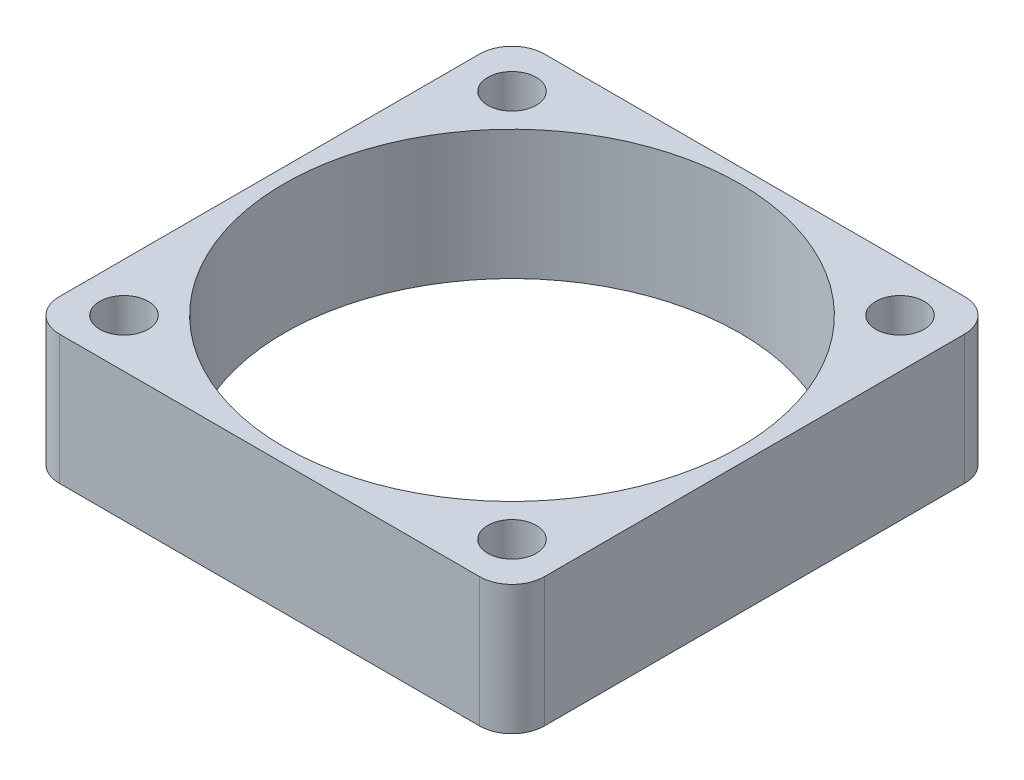
ISO-10303-21;
HEADER;
FILE_DESCRIPTION(('STEP AP214'),'2;1');
FILE_NAME('part.step','',(''),(''),'','','');
FILE_SCHEMA(('AUTOMOTIVE_DESIGN { 1 0 10303 214 1 1 1 1 }'));
ENDSEC;
DATA;
#1=APPLICATION_CONTEXT('core data for automotive mechanical design processes');
#2=APPLICATION_PROTOCOL_DEFINITION('international standard','automotive_design',2000,#1);
#3=PRODUCT_CONTEXT('',#1,'mechanical');
#4=PRODUCT('Part','Part','',(#3));
#5=PRODUCT_RELATED_PRODUCT_CATEGORY('part','',(#4));
#6=PRODUCT_DEFINITION_FORMATION('','',#4);
#7=PRODUCT_DEFINITION_CONTEXT('part definition',#1,'design');
#8=PRODUCT_DEFINITION('design','',#6,#7);
#9=PRODUCT_DEFINITION_SHAPE('','',#8);
#10=(LENGTH_UNIT() NAMED_UNIT(*) SI_UNIT(.MILLI.,.METRE.));
#11=(NAMED_UNIT(*) PLANE_ANGLE_UNIT() SI_UNIT($,.RADIAN.));
#12=(NAMED_UNIT(*) SI_UNIT($,.STERADIAN.) SOLID_ANGLE_UNIT());
#13=UNCERTAINTY_MEASURE_WITH_UNIT(LENGTH_MEASURE(1.E-05),#10,'distance_accuracy_value','');
#14=(GEOMETRIC_REPRESENTATION_CONTEXT(3) GLOBAL_UNCERTAINTY_ASSIGNED_CONTEXT((#13)) GLOBAL_UNIT_ASSIGNED_CONTEXT((#10,
#11,#12)) REPRESENTATION_CONTEXT('',''));
#15=CARTESIAN_POINT('',(0.,0.,0.));
#16=DIRECTION('',(0.,0.,1.));
#17=DIRECTION('',(1.,0.,0.));
#18=AXIS2_PLACEMENT_3D('',#15,#16,#17);
#19=CARTESIAN_POINT('',(-15.,8.,-15.));
#20=DIRECTION('',(1.,0.,0.));
#21=DIRECTION('',(0.,0.,-1.));
#22=AXIS2_PLACEMENT_3D('',#19,#20,#21);
#23=PLANE('',#22);
#24=DIRECTION('',(0.,0.,1.));
#25=VECTOR('',#24,1.);
#26=CARTESIAN_POINT('',(-15.,8.,-15.));
#27=LINE('',#26,#25);
#28=CARTESIAN_POINT('',(-15.,8.,-13.));
#29=VERTEX_POINT('',#28);
#30=CARTESIAN_POINT('',(-15.,8.,13.));
#31=VERTEX_POINT('',#30);
#32=EDGE_CURVE('E117',#29,#31,#27,.T.);
#33=ORIENTED_EDGE('',*,*,#32,.F.);
#34=DIRECTION('',(0.,-1.,0.));
#35=VECTOR('',#34,1.);
#36=CARTESIAN_POINT('',(-15.,8.,-13.));
#37=LINE('',#36,#35);
#38=CARTESIAN_POINT('',(-15.,0.,-13.));
#39=VERTEX_POINT('',#38);
#40=EDGE_CURVE('E102',#29,#39,#37,.T.);
#41=ORIENTED_EDGE('',*,*,#40,.T.);
#42=DIRECTION('',(0.,0.,1.));
#43=VECTOR('',#42,1.);
#44=CARTESIAN_POINT('',(-15.,0.,-15.));
#45=LINE('',#44,#43);
#46=CARTESIAN_POINT('',(-15.,0.,13.));
#47=VERTEX_POINT('',#46);
#48=EDGE_CURVE('E114',#39,#47,#45,.T.);
#49=ORIENTED_EDGE('',*,*,#48,.T.);
#50=DIRECTION('',(0.,-1.,0.));
#51=VECTOR('',#50,1.);
#52=CARTESIAN_POINT('',(-15.,8.,13.));
#53=LINE('',#52,#51);
#54=EDGE_CURVE('E119',#47,#31,#53,.F.);
#55=ORIENTED_EDGE('',*,*,#54,.T.);
#56=EDGE_LOOP('',(#33,#41,#49,#55));
#57=FACE_BOUND('',#56,.T.);
#58=ADVANCED_FACE('F33',(#57),#23,.F.);
#59=CARTESIAN_POINT('',(15.,8.,15.));
#60=DIRECTION('',(0.,0.,-1.));
#61=DIRECTION('',(-1.,0.,0.));
#62=AXIS2_PLACEMENT_3D('',#59,#60,#61);
#63=PLANE('',#62);
#64=DIRECTION('',(1.,0.,0.));
#65=VECTOR('',#64,1.);
#66=CARTESIAN_POINT('',(15.,8.,15.));
#67=LINE('',#66,#65);
#68=CARTESIAN_POINT('',(-13.,8.,15.));
#69=VERTEX_POINT('',#68);
#70=CARTESIAN_POINT('',(13.,8.,15.));
#71=VERTEX_POINT('',#70);
#72=EDGE_CURVE('E172',#69,#71,#67,.T.);
#73=ORIENTED_EDGE('',*,*,#72,.F.);
#74=DIRECTION('',(0.,-1.,0.));
#75=VECTOR('',#74,1.);
#76=CARTESIAN_POINT('',(-13.,8.,15.));
#77=LINE('',#76,#75);
#78=CARTESIAN_POINT('',(-13.,0.,15.));
#79=VERTEX_POINT('',#78);
#80=EDGE_CURVE('E156',#69,#79,#77,.T.);
#81=ORIENTED_EDGE('',*,*,#80,.T.);
#82=DIRECTION('',(1.,0.,0.));
#83=VECTOR('',#82,1.);
#84=CARTESIAN_POINT('',(15.,0.,15.));
#85=LINE('',#84,#83);
#86=CARTESIAN_POINT('',(13.,0.,15.));
#87=VERTEX_POINT('',#86);
#88=EDGE_CURVE('E123',#79,#87,#85,.T.);
#89=ORIENTED_EDGE('',*,*,#88,.T.);
#90=DIRECTION('',(0.,-1.,0.));
#91=VECTOR('',#90,1.);
#92=CARTESIAN_POINT('',(13.,8.,15.));
#93=LINE('',#92,#91);
#94=EDGE_CURVE('E154',#87,#71,#93,.F.);
#95=ORIENTED_EDGE('',*,*,#94,.T.);
#96=EDGE_LOOP('',(#73,#81,#89,#95));
#97=FACE_BOUND('',#96,.T.);
#98=ADVANCED_FACE('F239',(#97),#63,.F.);
#99=CARTESIAN_POINT('',(15.,8.,-15.));
#100=DIRECTION('',(-1.,0.,0.));
#101=DIRECTION('',(0.,0.,1.));
#102=AXIS2_PLACEMENT_3D('',#99,#100,#101);
#103=PLANE('',#102);
#104=DIRECTION('',(0.,0.,-1.));
#105=VECTOR('',#104,1.);
#106=CARTESIAN_POINT('',(15.,0.,-15.));
#107=LINE('',#106,#105);
#108=CARTESIAN_POINT('',(15.,0.,13.));
#109=VERTEX_POINT('',#108);
#110=CARTESIAN_POINT('',(15.,0.,-13.));
#111=VERTEX_POINT('',#110);
#112=EDGE_CURVE('E127',#109,#111,#107,.T.);
#113=ORIENTED_EDGE('',*,*,#112,.T.);
#114=DIRECTION('',(0.,-1.,0.));
#115=VECTOR('',#114,1.);
#116=CARTESIAN_POINT('',(15.,8.,-13.));
#117=LINE('',#116,#115);
#118=CARTESIAN_POINT('',(15.,8.,-13.));
#119=VERTEX_POINT('',#118);
#120=EDGE_CURVE('E11',#111,#119,#117,.F.);
#121=ORIENTED_EDGE('',*,*,#120,.T.);
#122=DIRECTION('',(0.,0.,-1.));
#123=VECTOR('',#122,1.);
#124=CARTESIAN_POINT('',(15.,8.,-15.));
#125=LINE('',#124,#123);
#126=CARTESIAN_POINT('',(15.,8.,13.));
#127=VERTEX_POINT('',#126);
#128=EDGE_CURVE('E162',#127,#119,#125,.T.);
#129=ORIENTED_EDGE('',*,*,#128,.F.);
#130=DIRECTION('',(0.,-1.,0.));
#131=VECTOR('',#130,1.);
#132=CARTESIAN_POINT('',(15.,8.,13.));
#133=LINE('',#132,#131);
#134=EDGE_CURVE('E41',#127,#109,#133,.T.);
#135=ORIENTED_EDGE('',*,*,#134,.T.);
#136=EDGE_LOOP('',(#113,#121,#129,#135));
#137=FACE_BOUND('',#136,.T.);
#138=ADVANCED_FACE('F161',(#137),#103,.F.);
#139=CARTESIAN_POINT('',(15.,8.,-15.));
#140=DIRECTION('',(0.,0.,1.));
#141=DIRECTION('',(1.,0.,0.));
#142=AXIS2_PLACEMENT_3D('',#139,#140,#141);
#143=PLANE('',#142);
#144=DIRECTION('',(-1.,0.,0.));
#145=VECTOR('',#144,1.);
#146=CARTESIAN_POINT('',(15.,0.,-15.));
#147=LINE('',#146,#145);
#148=CARTESIAN_POINT('',(13.,0.,-15.));
#149=VERTEX_POINT('',#148);
#150=CARTESIAN_POINT('',(-13.,0.,-15.));
#151=VERTEX_POINT('',#150);
#152=EDGE_CURVE('E137',#149,#151,#147,.T.);
#153=ORIENTED_EDGE('',*,*,#152,.T.);
#154=DIRECTION('',(0.,-1.,0.));
#155=VECTOR('',#154,1.);
#156=CARTESIAN_POINT('',(-13.,8.,-15.));
#157=LINE('',#156,#155);
#158=CARTESIAN_POINT('',(-13.,8.,-15.));
#159=VERTEX_POINT('',#158);
#160=EDGE_CURVE('E103',#151,#159,#157,.F.);
#161=ORIENTED_EDGE('',*,*,#160,.T.);
#162=DIRECTION('',(-1.,0.,0.));
#163=VECTOR('',#162,1.);
#164=CARTESIAN_POINT('',(15.,8.,-15.));
#165=LINE('',#164,#163);
#166=CARTESIAN_POINT('',(13.,8.,-15.));
#167=VERTEX_POINT('',#166);
#168=EDGE_CURVE('E133',#167,#159,#165,.T.);
#169=ORIENTED_EDGE('',*,*,#168,.F.);
#170=DIRECTION('',(0.,-1.,0.));
#171=VECTOR('',#170,1.);
#172=CARTESIAN_POINT('',(13.,8.,-15.));
#173=LINE('',#172,#171);
#174=EDGE_CURVE('E108',#167,#149,#173,.T.);
#175=ORIENTED_EDGE('',*,*,#174,.T.);
#176=EDGE_LOOP('',(#153,#161,#169,#175));
#177=FACE_BOUND('',#176,.T.);
#178=ADVANCED_FACE('F170',(#177),#143,.F.);
#179=CARTESIAN_POINT('',(0.,8.,0.));
#180=DIRECTION('',(0.,-1.,0.));
#181=DIRECTION('',(0.,0.,-1.));
#182=AXIS2_PLACEMENT_3D('',#179,#180,#181);
#183=PLANE('',#182);
#184=CARTESIAN_POINT('',(0.,8.,0.));
#185=DIRECTION('',(0.,1.,0.));
#186=DIRECTION('',(0.,0.,1.));
#187=AXIS2_PLACEMENT_3D('',#184,#185,#186);
#188=CIRCLE('',#187,14.1);
#189=CARTESIAN_POINT('',(0.,8.,14.1));
#190=VERTEX_POINT('',#189);
#191=EDGE_CURVE('E197',#190,#190,#188,.T.);
#192=ORIENTED_EDGE('',*,*,#191,.F.);
#193=EDGE_LOOP('',(#192));
#194=FACE_BOUND('',#193,.T.);
#195=CARTESIAN_POINT('',(12.,8.,-12.));
#196=DIRECTION('',(0.,1.,0.));
#197=DIRECTION('',(0.,0.,1.));
#198=AXIS2_PLACEMENT_3D('',#195,#196,#197);
#199=CIRCLE('',#198,1.5);
#200=CARTESIAN_POINT('',(12.,8.,-10.5));
#201=VERTEX_POINT('',#200);
#202=EDGE_CURVE('E186',#201,#201,#199,.T.);
#203=ORIENTED_EDGE('',*,*,#202,.F.);
#204=EDGE_LOOP('',(#203));
#205=FACE_BOUND('',#204,.T.);
#206=CARTESIAN_POINT('',(-12.,8.,12.));
#207=DIRECTION('',(0.,1.,0.));
#208=DIRECTION('',(0.,0.,1.));
#209=AXIS2_PLACEMENT_3D('',#206,#207,#208);
#210=CIRCLE('',#209,1.5);
#211=CARTESIAN_POINT('',(-12.,8.,13.5));
#212=VERTEX_POINT('',#211);
#213=EDGE_CURVE('E179',#212,#212,#210,.T.);
#214=ORIENTED_EDGE('',*,*,#213,.F.);
#215=EDGE_LOOP('',(#214));
#216=FACE_BOUND('',#215,.T.);
#217=CARTESIAN_POINT('',(12.,8.,12.));
#218=DIRECTION('',(0.,1.,0.));
#219=DIRECTION('',(0.,0.,1.));
#220=AXIS2_PLACEMENT_3D('',#217,#218,#219);
#221=CIRCLE('',#220,1.5);
#222=CARTESIAN_POINT('',(12.,8.,13.5));
#223=VERTEX_POINT('',#222);
#224=EDGE_CURVE('E191',#223,#223,#221,.T.);
#225=ORIENTED_EDGE('',*,*,#224,.F.);
#226=EDGE_LOOP('',(#225));
#227=FACE_BOUND('',#226,.T.);
#228=CARTESIAN_POINT('',(-12.,8.,-12.));
#229=DIRECTION('',(0.,1.,0.));
#230=DIRECTION('',(0.,0.,1.));
#231=AXIS2_PLACEMENT_3D('',#228,#229,#230);
#232=CIRCLE('',#231,1.5);
#233=CARTESIAN_POINT('',(-12.,8.,-10.5));
#234=VERTEX_POINT('',#233);
#235=EDGE_CURVE('E130',#234,#234,#232,.T.);
#236=ORIENTED_EDGE('',*,*,#235,.F.);
#237=EDGE_LOOP('',(#236));
#238=FACE_BOUND('',#237,.T.);
#239=ORIENTED_EDGE('',*,*,#168,.T.);
#240=CARTESIAN_POINT('',(-13.,8.,-13.));
#241=DIRECTION('',(0.,-1.,0.));
#242=DIRECTION('',(0.,0.,-1.));
#243=AXIS2_PLACEMENT_3D('',#240,#241,#242);
#244=CIRCLE('',#243,2.);
#245=EDGE_CURVE('E152',#159,#29,#244,.F.);
#246=ORIENTED_EDGE('',*,*,#245,.T.);
#247=ORIENTED_EDGE('',*,*,#32,.T.);
#248=CARTESIAN_POINT('',(-13.,8.,13.));
#249=DIRECTION('',(0.,-1.,0.));
#250=DIRECTION('',(0.,0.,-1.));
#251=AXIS2_PLACEMENT_3D('',#248,#249,#250);
#252=CIRCLE('',#251,2.);
#253=EDGE_CURVE('E150',#31,#69,#252,.F.);
#254=ORIENTED_EDGE('',*,*,#253,.T.);
#255=ORIENTED_EDGE('',*,*,#72,.T.);
#256=CARTESIAN_POINT('',(13.,8.,13.));
#257=DIRECTION('',(0.,-1.,0.));
#258=DIRECTION('',(0.,0.,-1.));
#259=AXIS2_PLACEMENT_3D('',#256,#257,#258);
#260=CIRCLE('',#259,2.);
#261=EDGE_CURVE('E53',#71,#127,#260,.F.);
#262=ORIENTED_EDGE('',*,*,#261,.T.);
#263=ORIENTED_EDGE('',*,*,#128,.T.);
#264=CARTESIAN_POINT('',(13.,8.,-13.));
#265=DIRECTION('',(0.,-1.,0.));
#266=DIRECTION('',(0.,0.,-1.));
#267=AXIS2_PLACEMENT_3D('',#264,#265,#266);
#268=CIRCLE('',#267,2.);
#269=EDGE_CURVE('E148',#119,#167,#268,.F.);
#270=ORIENTED_EDGE('',*,*,#269,.T.);
#271=EDGE_LOOP('',(#239,#246,#247,#254,#255,#262,#263,#270));
#272=FACE_BOUND('',#271,.T.);
#273=ADVANCED_FACE('F212',(#194,#205,#216,#227,#238,#272),#183,.F.);
#274=CARTESIAN_POINT('',(0.,0.,0.));
#275=DIRECTION('',(0.,-1.,0.));
#276=DIRECTION('',(0.,0.,-1.));
#277=AXIS2_PLACEMENT_3D('',#274,#275,#276);
#278=PLANE('',#277);
#279=CARTESIAN_POINT('',(0.,0.,0.));
#280=DIRECTION('',(0.,1.,0.));
#281=DIRECTION('',(0.,0.,1.));
#282=AXIS2_PLACEMENT_3D('',#279,#280,#281);
#283=CIRCLE('',#282,14.1);
#284=CARTESIAN_POINT('',(0.,0.,14.1));
#285=VERTEX_POINT('',#284);
#286=EDGE_CURVE('E194',#285,#285,#283,.T.);
#287=ORIENTED_EDGE('',*,*,#286,.T.);
#288=EDGE_LOOP('',(#287));
#289=FACE_BOUND('',#288,.T.);
#290=CARTESIAN_POINT('',(12.,0.,-12.));
#291=DIRECTION('',(0.,1.,0.));
#292=DIRECTION('',(0.,0.,1.));
#293=AXIS2_PLACEMENT_3D('',#290,#291,#292);
#294=CIRCLE('',#293,1.5);
#295=CARTESIAN_POINT('',(12.,0.,-10.5));
#296=VERTEX_POINT('',#295);
#297=EDGE_CURVE('E177',#296,#296,#294,.T.);
#298=ORIENTED_EDGE('',*,*,#297,.T.);
#299=EDGE_LOOP('',(#298));
#300=FACE_BOUND('',#299,.T.);
#301=CARTESIAN_POINT('',(-12.,0.,12.));
#302=DIRECTION('',(0.,1.,0.));
#303=DIRECTION('',(0.,0.,1.));
#304=AXIS2_PLACEMENT_3D('',#301,#302,#303);
#305=CIRCLE('',#304,1.5);
#306=CARTESIAN_POINT('',(-12.,0.,13.5));
#307=VERTEX_POINT('',#306);
#308=EDGE_CURVE('E182',#307,#307,#305,.T.);
#309=ORIENTED_EDGE('',*,*,#308,.T.);
#310=EDGE_LOOP('',(#309));
#311=FACE_BOUND('',#310,.T.);
#312=CARTESIAN_POINT('',(12.,0.,12.));
#313=DIRECTION('',(0.,1.,0.));
#314=DIRECTION('',(0.,0.,1.));
#315=AXIS2_PLACEMENT_3D('',#312,#313,#314);
#316=CIRCLE('',#315,1.5);
#317=CARTESIAN_POINT('',(12.,0.,13.5));
#318=VERTEX_POINT('',#317);
#319=EDGE_CURVE('E183',#318,#318,#316,.T.);
#320=ORIENTED_EDGE('',*,*,#319,.T.);
#321=EDGE_LOOP('',(#320));
#322=FACE_BOUND('',#321,.T.);
#323=CARTESIAN_POINT('',(-12.,0.,-12.));
#324=DIRECTION('',(0.,1.,0.));
#325=DIRECTION('',(0.,0.,1.));
#326=AXIS2_PLACEMENT_3D('',#323,#324,#325);
#327=CIRCLE('',#326,1.5);
#328=CARTESIAN_POINT('',(-12.,0.,-10.5));
#329=VERTEX_POINT('',#328);
#330=EDGE_CURVE('E124',#329,#329,#327,.T.);
#331=ORIENTED_EDGE('',*,*,#330,.T.);
#332=EDGE_LOOP('',(#331));
#333=FACE_BOUND('',#332,.T.);
#334=ORIENTED_EDGE('',*,*,#48,.F.);
#335=CARTESIAN_POINT('',(-13.,0.,-13.));
#336=DIRECTION('',(0.,-1.,0.));
#337=DIRECTION('',(0.,0.,-1.));
#338=AXIS2_PLACEMENT_3D('',#335,#336,#337);
#339=CIRCLE('',#338,2.);
#340=EDGE_CURVE('E98',#39,#151,#339,.T.);
#341=ORIENTED_EDGE('',*,*,#340,.T.);
#342=ORIENTED_EDGE('',*,*,#152,.F.);
#343=CARTESIAN_POINT('',(13.,0.,-13.));
#344=DIRECTION('',(0.,-1.,0.));
#345=DIRECTION('',(0.,0.,-1.));
#346=AXIS2_PLACEMENT_3D('',#343,#344,#345);
#347=CIRCLE('',#346,2.);
#348=EDGE_CURVE('E141',#149,#111,#347,.T.);
#349=ORIENTED_EDGE('',*,*,#348,.T.);
#350=ORIENTED_EDGE('',*,*,#112,.F.);
#351=CARTESIAN_POINT('',(13.,0.,13.));
#352=DIRECTION('',(0.,-1.,0.));
#353=DIRECTION('',(0.,0.,-1.));
#354=AXIS2_PLACEMENT_3D('',#351,#352,#353);
#355=CIRCLE('',#354,2.);
#356=EDGE_CURVE('E118',#109,#87,#355,.T.);
#357=ORIENTED_EDGE('',*,*,#356,.T.);
#358=ORIENTED_EDGE('',*,*,#88,.F.);
#359=CARTESIAN_POINT('',(-13.,0.,13.));
#360=DIRECTION('',(0.,-1.,0.));
#361=DIRECTION('',(0.,0.,-1.));
#362=AXIS2_PLACEMENT_3D('',#359,#360,#361);
#363=CIRCLE('',#362,2.);
#364=EDGE_CURVE('E109',#79,#47,#363,.T.);
#365=ORIENTED_EDGE('',*,*,#364,.T.);
#366=EDGE_LOOP('',(#334,#341,#342,#349,#350,#357,#358,#365));
#367=FACE_BOUND('',#366,.T.);
#368=ADVANCED_FACE('F121',(#289,#300,#311,#322,#333,#367),#278,.T.);
#369=CARTESIAN_POINT('',(-13.,8.,-13.));
#370=DIRECTION('',(0.,-1.,0.));
#371=DIRECTION('',(0.,0.,-1.));
#372=AXIS2_PLACEMENT_3D('',#369,#370,#371);
#373=CYLINDRICAL_SURFACE('',#372,2.);
#374=ORIENTED_EDGE('',*,*,#245,.F.);
#375=ORIENTED_EDGE('',*,*,#160,.F.);
#376=ORIENTED_EDGE('',*,*,#340,.F.);
#377=ORIENTED_EDGE('',*,*,#40,.F.);
#378=EDGE_LOOP('',(#374,#375,#376,#377));
#379=FACE_BOUND('',#378,.T.);
#380=ADVANCED_FACE('F101',(#379),#373,.T.);
#381=CARTESIAN_POINT('',(-13.,8.,13.));
#382=DIRECTION('',(0.,-1.,0.));
#383=DIRECTION('',(0.,0.,-1.));
#384=AXIS2_PLACEMENT_3D('',#381,#382,#383);
#385=CYLINDRICAL_SURFACE('',#384,2.);
#386=ORIENTED_EDGE('',*,*,#253,.F.);
#387=ORIENTED_EDGE('',*,*,#54,.F.);
#388=ORIENTED_EDGE('',*,*,#364,.F.);
#389=ORIENTED_EDGE('',*,*,#80,.F.);
#390=EDGE_LOOP('',(#386,#387,#388,#389));
#391=FACE_BOUND('',#390,.T.);
#392=ADVANCED_FACE('F250',(#391),#385,.T.);
#393=CARTESIAN_POINT('',(13.,8.,-13.));
#394=DIRECTION('',(0.,-1.,0.));
#395=DIRECTION('',(0.,0.,-1.));
#396=AXIS2_PLACEMENT_3D('',#393,#394,#395);
#397=CYLINDRICAL_SURFACE('',#396,2.);
#398=ORIENTED_EDGE('',*,*,#269,.F.);
#399=ORIENTED_EDGE('',*,*,#120,.F.);
#400=ORIENTED_EDGE('',*,*,#348,.F.);
#401=ORIENTED_EDGE('',*,*,#174,.F.);
#402=EDGE_LOOP('',(#398,#399,#400,#401));
#403=FACE_BOUND('',#402,.T.);
#404=ADVANCED_FACE('F167',(#403),#397,.T.);
#405=CARTESIAN_POINT('',(13.,8.,13.));
#406=DIRECTION('',(0.,-1.,0.));
#407=DIRECTION('',(0.,0.,-1.));
#408=AXIS2_PLACEMENT_3D('',#405,#406,#407);
#409=CYLINDRICAL_SURFACE('',#408,2.);
#410=ORIENTED_EDGE('',*,*,#261,.F.);
#411=ORIENTED_EDGE('',*,*,#94,.F.);
#412=ORIENTED_EDGE('',*,*,#356,.F.);
#413=ORIENTED_EDGE('',*,*,#134,.F.);
#414=EDGE_LOOP('',(#410,#411,#412,#413));
#415=FACE_BOUND('',#414,.T.);
#416=ADVANCED_FACE('F35',(#415),#409,.T.);
#417=CARTESIAN_POINT('',(-12.,0.,-12.));
#418=DIRECTION('',(0.,1.,0.));
#419=DIRECTION('',(0.,0.,1.));
#420=AXIS2_PLACEMENT_3D('',#417,#418,#419);
#421=CYLINDRICAL_SURFACE('',#420,1.5);
#422=ORIENTED_EDGE('',*,*,#330,.F.);
#423=EDGE_LOOP('',(#422));
#424=FACE_BOUND('',#423,.T.);
#425=ORIENTED_EDGE('',*,*,#235,.T.);
#426=EDGE_LOOP('',(#425));
#427=FACE_BOUND('',#426,.T.);
#428=ADVANCED_FACE('F224',(#424,#427),#421,.F.);
#429=CARTESIAN_POINT('',(12.,0.,12.));
#430=DIRECTION('',(0.,1.,0.));
#431=DIRECTION('',(0.,0.,1.));
#432=AXIS2_PLACEMENT_3D('',#429,#430,#431);
#433=CYLINDRICAL_SURFACE('',#432,1.5);
#434=ORIENTED_EDGE('',*,*,#319,.F.);
#435=EDGE_LOOP('',(#434));
#436=FACE_BOUND('',#435,.T.);
#437=ORIENTED_EDGE('',*,*,#224,.T.);
#438=EDGE_LOOP('',(#437));
#439=FACE_BOUND('',#438,.T.);
#440=ADVANCED_FACE('F226',(#436,#439),#433,.F.);
#441=CARTESIAN_POINT('',(-12.,0.,12.));
#442=DIRECTION('',(0.,1.,0.));
#443=DIRECTION('',(0.,0.,1.));
#444=AXIS2_PLACEMENT_3D('',#441,#442,#443);
#445=CYLINDRICAL_SURFACE('',#444,1.5);
#446=ORIENTED_EDGE('',*,*,#308,.F.);
#447=EDGE_LOOP('',(#446));
#448=FACE_BOUND('',#447,.T.);
#449=ORIENTED_EDGE('',*,*,#213,.T.);
#450=EDGE_LOOP('',(#449));
#451=FACE_BOUND('',#450,.T.);
#452=ADVANCED_FACE('F233',(#448,#451),#445,.F.);
#453=CARTESIAN_POINT('',(12.,0.,-12.));
#454=DIRECTION('',(0.,1.,0.));
#455=DIRECTION('',(0.,0.,1.));
#456=AXIS2_PLACEMENT_3D('',#453,#454,#455);
#457=CYLINDRICAL_SURFACE('',#456,1.5);
#458=ORIENTED_EDGE('',*,*,#297,.F.);
#459=EDGE_LOOP('',(#458));
#460=FACE_BOUND('',#459,.T.);
#461=ORIENTED_EDGE('',*,*,#202,.T.);
#462=EDGE_LOOP('',(#461));
#463=FACE_BOUND('',#462,.T.);
#464=ADVANCED_FACE('F208',(#460,#463),#457,.F.);
#465=CARTESIAN_POINT('',(0.,0.,0.));
#466=DIRECTION('',(0.,1.,0.));
#467=DIRECTION('',(0.,0.,1.));
#468=AXIS2_PLACEMENT_3D('',#465,#466,#467);
#469=CYLINDRICAL_SURFACE('',#468,14.1);
#470=ORIENTED_EDGE('',*,*,#286,.F.);
#471=EDGE_LOOP('',(#470));
#472=FACE_BOUND('',#471,.T.);
#473=ORIENTED_EDGE('',*,*,#191,.T.);
#474=EDGE_LOOP('',(#473));
#475=FACE_BOUND('',#474,.T.);
#476=ADVANCED_FACE('F205',(#472,#475),#469,.F.);
#477=CLOSED_SHELL('',(#58,#98,#138,#178,#273,#368,#380,#392,#404,#416,#428,#440,#452,#464,#476));
#478=MANIFOLD_SOLID_BREP('B2',#477);
#479=ADVANCED_BREP_SHAPE_REPRESENTATION('',(#18,#478),#14);
#480=SHAPE_DEFINITION_REPRESENTATION(#9,#479);
ENDSEC;
END-ISO-10303-21;
